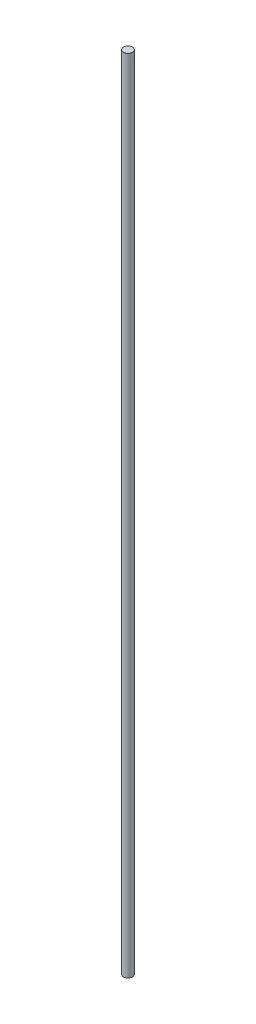
ISO-10303-21;
HEADER;
FILE_DESCRIPTION(('STEP AP214'),'2;1');
FILE_NAME('part.step','',(''),(''),'','','');
FILE_SCHEMA(('AUTOMOTIVE_DESIGN { 1 0 10303 214 1 1 1 1 }'));
ENDSEC;
DATA;
#1=APPLICATION_CONTEXT('core data for automotive mechanical design processes');
#2=APPLICATION_PROTOCOL_DEFINITION('international standard','automotive_design',2000,#1);
#3=PRODUCT_CONTEXT('',#1,'mechanical');
#4=PRODUCT('Part','Part','',(#3));
#5=PRODUCT_RELATED_PRODUCT_CATEGORY('part','',(#4));
#6=PRODUCT_DEFINITION_FORMATION('','',#4);
#7=PRODUCT_DEFINITION_CONTEXT('part definition',#1,'design');
#8=PRODUCT_DEFINITION('design','',#6,#7);
#9=PRODUCT_DEFINITION_SHAPE('','',#8);
#10=(LENGTH_UNIT() NAMED_UNIT(*) SI_UNIT(.MILLI.,.METRE.));
#11=(NAMED_UNIT(*) PLANE_ANGLE_UNIT() SI_UNIT($,.RADIAN.));
#12=(NAMED_UNIT(*) SI_UNIT($,.STERADIAN.) SOLID_ANGLE_UNIT());
#13=UNCERTAINTY_MEASURE_WITH_UNIT(LENGTH_MEASURE(1.E-05),#10,'distance_accuracy_value','');
#14=(GEOMETRIC_REPRESENTATION_CONTEXT(3) GLOBAL_UNCERTAINTY_ASSIGNED_CONTEXT((#13)) GLOBAL_UNIT_ASSIGNED_CONTEXT((#10,
#11,#12)) REPRESENTATION_CONTEXT('',''));
#15=CARTESIAN_POINT('',(0.,0.,0.));
#16=DIRECTION('',(0.,0.,1.));
#17=DIRECTION('',(1.,0.,0.));
#18=AXIS2_PLACEMENT_3D('',#15,#16,#17);
#19=CARTESIAN_POINT('',(0.,558.8,0.));
#20=DIRECTION('',(0.,-1.,0.));
#21=DIRECTION('',(0.,0.,-1.));
#22=AXIS2_PLACEMENT_3D('',#19,#20,#21);
#23=CYLINDRICAL_SURFACE('',#22,3.175);
#24=CARTESIAN_POINT('',(0.,558.8,0.));
#25=DIRECTION('',(0.,1.,0.));
#26=DIRECTION('',(0.,0.,1.));
#27=AXIS2_PLACEMENT_3D('',#24,#25,#26);
#28=CIRCLE('',#27,3.175);
#29=CARTESIAN_POINT('',(0.,558.8,3.175));
#30=VERTEX_POINT('',#29);
#31=EDGE_CURVE('E10',#30,#30,#28,.T.);
#32=ORIENTED_EDGE('',*,*,#31,.F.);
#33=EDGE_LOOP('',(#32));
#34=FACE_BOUND('',#33,.T.);
#35=CARTESIAN_POINT('',(0.,0.,0.));
#36=DIRECTION('',(0.,1.,0.));
#37=DIRECTION('',(0.,0.,1.));
#38=AXIS2_PLACEMENT_3D('',#35,#36,#37);
#39=CIRCLE('',#38,3.175);
#40=CARTESIAN_POINT('',(0.,0.,3.175));
#41=VERTEX_POINT('',#40);
#42=EDGE_CURVE('E40',#41,#41,#39,.T.);
#43=ORIENTED_EDGE('',*,*,#42,.T.);
#44=EDGE_LOOP('',(#43));
#45=FACE_BOUND('',#44,.T.);
#46=ADVANCED_FACE('F37',(#34,#45),#23,.T.);
#47=CARTESIAN_POINT('',(0.,558.8,0.));
#48=DIRECTION('',(0.,1.,0.));
#49=DIRECTION('',(0.,0.,1.));
#50=AXIS2_PLACEMENT_3D('',#47,#48,#49);
#51=PLANE('',#50);
#52=ORIENTED_EDGE('',*,*,#31,.T.);
#53=EDGE_LOOP('',(#52));
#54=FACE_BOUND('',#53,.T.);
#55=ADVANCED_FACE('F54',(#54),#51,.T.);
#56=CARTESIAN_POINT('',(0.,0.,0.));
#57=DIRECTION('',(0.,1.,0.));
#58=DIRECTION('',(0.,0.,1.));
#59=AXIS2_PLACEMENT_3D('',#56,#57,#58);
#60=PLANE('',#59);
#61=ORIENTED_EDGE('',*,*,#42,.F.);
#62=EDGE_LOOP('',(#61));
#63=FACE_BOUND('',#62,.T.);
#64=ADVANCED_FACE('F52',(#63),#60,.F.);
#65=CLOSED_SHELL('',(#46,#55,#64));
#66=MANIFOLD_SOLID_BREP('B2',#65);
#67=ADVANCED_BREP_SHAPE_REPRESENTATION('',(#18,#66),#14);
#68=SHAPE_DEFINITION_REPRESENTATION(#9,#67);
ENDSEC;
END-ISO-10303-21;
